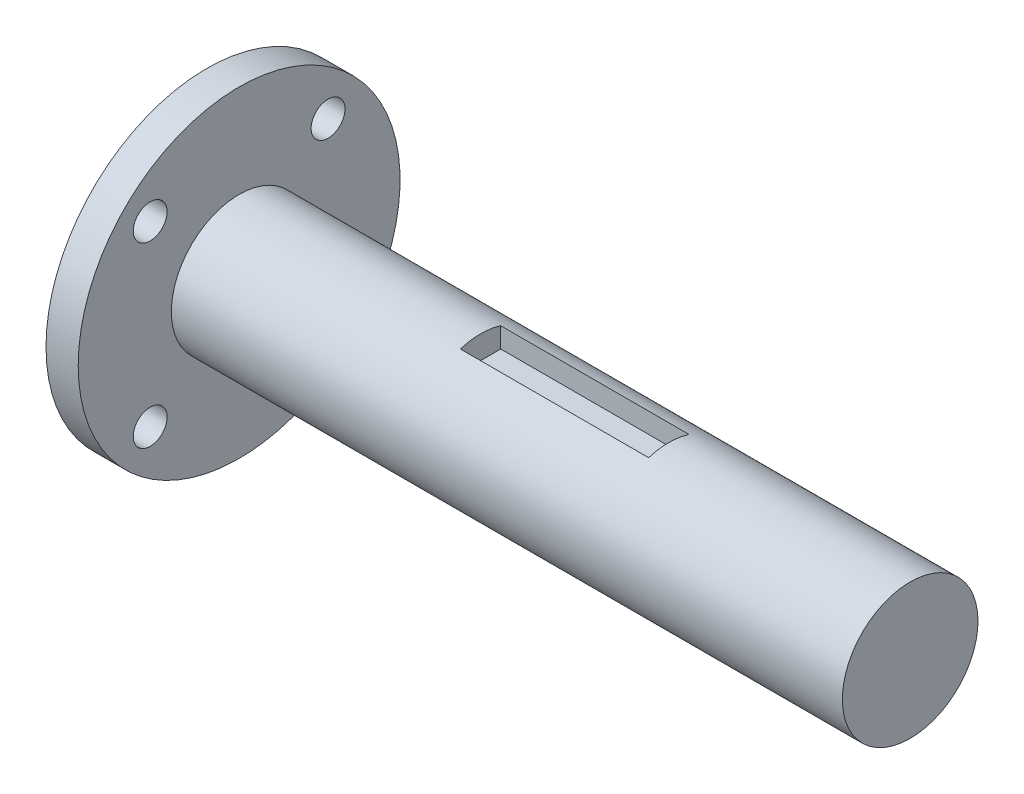
ISO-10303-21;
HEADER;
FILE_DESCRIPTION(('STEP AP214'),'2;1');
FILE_NAME('part.step','',(''),(''),'','','');
FILE_SCHEMA(('AUTOMOTIVE_DESIGN { 1 0 10303 214 1 1 1 1 }'));
ENDSEC;
DATA;
#1=APPLICATION_CONTEXT('core data for automotive mechanical design processes');
#2=APPLICATION_PROTOCOL_DEFINITION('international standard','automotive_design',2000,#1);
#3=PRODUCT_CONTEXT('',#1,'mechanical');
#4=PRODUCT('Part','Part','',(#3));
#5=PRODUCT_RELATED_PRODUCT_CATEGORY('part','',(#4));
#6=PRODUCT_DEFINITION_FORMATION('','',#4);
#7=PRODUCT_DEFINITION_CONTEXT('part definition',#1,'design');
#8=PRODUCT_DEFINITION('design','',#6,#7);
#9=PRODUCT_DEFINITION_SHAPE('','',#8);
#10=(LENGTH_UNIT() NAMED_UNIT(*) SI_UNIT(.MILLI.,.METRE.));
#11=(NAMED_UNIT(*) PLANE_ANGLE_UNIT() SI_UNIT($,.RADIAN.));
#12=(NAMED_UNIT(*) SI_UNIT($,.STERADIAN.) SOLID_ANGLE_UNIT());
#13=UNCERTAINTY_MEASURE_WITH_UNIT(LENGTH_MEASURE(1.E-05),#10,'distance_accuracy_value','');
#14=(GEOMETRIC_REPRESENTATION_CONTEXT(3) GLOBAL_UNCERTAINTY_ASSIGNED_CONTEXT((#13)) GLOBAL_UNIT_ASSIGNED_CONTEXT((#10,
#11,#12)) REPRESENTATION_CONTEXT('',''));
#15=CARTESIAN_POINT('',(0.,0.,0.));
#16=DIRECTION('',(0.,0.,1.));
#17=DIRECTION('',(1.,0.,0.));
#18=AXIS2_PLACEMENT_3D('',#15,#16,#17);
#19=CARTESIAN_POINT('',(28.5,0.,0.));
#20=DIRECTION('',(-1.,0.,0.));
#21=DIRECTION('',(0.,0.,1.));
#22=AXIS2_PLACEMENT_3D('',#19,#20,#21);
#23=CYLINDRICAL_SURFACE('',#22,8.005);
#24=CARTESIAN_POINT('',(28.5,0.,0.));
#25=DIRECTION('',(1.,0.,0.));
#26=DIRECTION('',(0.,0.,-1.));
#27=AXIS2_PLACEMENT_3D('',#24,#25,#26);
#28=CIRCLE('',#27,8.005);
#29=CARTESIAN_POINT('',(28.5,7.64254425894937,-2.3815));
#30=VERTEX_POINT('',#29);
#31=CARTESIAN_POINT('',(28.5,7.64254425894937,2.3815));
#32=VERTEX_POINT('',#31);
#33=EDGE_CURVE('E11',#30,#32,#28,.T.);
#34=ORIENTED_EDGE('',*,*,#33,.F.);
#35=DIRECTION('',(-1.,0.,0.));
#36=VECTOR('',#35,1.);
#37=CARTESIAN_POINT('',(50.725,7.64254425894937,-2.3815));
#38=LINE('',#37,#36);
#39=CARTESIAN_POINT('',(50.725,7.64254425894937,-2.3815));
#40=VERTEX_POINT('',#39);
#41=EDGE_CURVE('E102',#40,#30,#38,.T.);
#42=ORIENTED_EDGE('',*,*,#41,.F.);
#43=CARTESIAN_POINT('',(50.725,0.,0.));
#44=DIRECTION('',(1.,0.,0.));
#45=DIRECTION('',(0.,0.,-1.));
#46=AXIS2_PLACEMENT_3D('',#43,#44,#45);
#47=CIRCLE('',#46,8.005);
#48=CARTESIAN_POINT('',(50.725,7.64254425894937,2.3815));
#49=VERTEX_POINT('',#48);
#50=EDGE_CURVE('E180',#40,#49,#47,.T.);
#51=ORIENTED_EDGE('',*,*,#50,.T.);
#52=DIRECTION('',(-1.,0.,0.));
#53=VECTOR('',#52,1.);
#54=CARTESIAN_POINT('',(50.725,7.64254425894937,2.3815));
#55=LINE('',#54,#53);
#56=EDGE_CURVE('E74',#49,#32,#55,.T.);
#57=ORIENTED_EDGE('',*,*,#56,.T.);
#58=EDGE_LOOP('',(#34,#42,#51,#57));
#59=FACE_BOUND('',#58,.T.);
#60=CARTESIAN_POINT('',(0.,0.,0.));
#61=DIRECTION('',(1.,0.,0.));
#62=DIRECTION('',(0.,0.,-1.));
#63=AXIS2_PLACEMENT_3D('',#60,#61,#62);
#64=CIRCLE('',#63,8.005);
#65=CARTESIAN_POINT('',(0.,0.,-8.005));
#66=VERTEX_POINT('',#65);
#67=EDGE_CURVE('E36',#66,#66,#64,.T.);
#68=ORIENTED_EDGE('',*,*,#67,.T.);
#69=EDGE_LOOP('',(#68));
#70=FACE_BOUND('',#69,.T.);
#71=CARTESIAN_POINT('',(79.225,0.,0.));
#72=DIRECTION('',(1.,0.,0.));
#73=DIRECTION('',(0.,0.,-1.));
#74=AXIS2_PLACEMENT_3D('',#71,#72,#73);
#75=CIRCLE('',#74,8.005);
#76=CARTESIAN_POINT('',(79.225,0.,-8.005));
#77=VERTEX_POINT('',#76);
#78=EDGE_CURVE('E97',#77,#77,#75,.T.);
#79=ORIENTED_EDGE('',*,*,#78,.F.);
#80=EDGE_LOOP('',(#79));
#81=FACE_BOUND('',#80,.T.);
#82=ADVANCED_FACE('F33',(#59,#70,#81),#23,.T.);
#83=CARTESIAN_POINT('',(28.5,0.,0.));
#84=DIRECTION('',(1.,0.,0.));
#85=DIRECTION('',(0.,0.,-1.));
#86=AXIS2_PLACEMENT_3D('',#83,#84,#85);
#87=PLANE('',#86);
#88=DIRECTION('',(0.,1.,0.));
#89=VECTOR('',#88,1.);
#90=CARTESIAN_POINT('',(28.5,5.25954425894937,2.3815));
#91=LINE('',#90,#89);
#92=CARTESIAN_POINT('',(28.5,5.25954425894937,2.3815));
#93=VERTEX_POINT('',#92);
#94=EDGE_CURVE('E46',#93,#32,#91,.T.);
#95=ORIENTED_EDGE('',*,*,#94,.F.);
#96=DIRECTION('',(0.,0.,1.));
#97=VECTOR('',#96,1.);
#98=CARTESIAN_POINT('',(28.5,5.25954425894937,2.3815));
#99=LINE('',#98,#97);
#100=CARTESIAN_POINT('',(28.5,5.25954425894937,-2.3815));
#101=VERTEX_POINT('',#100);
#102=EDGE_CURVE('E80',#101,#93,#99,.T.);
#103=ORIENTED_EDGE('',*,*,#102,.F.);
#104=DIRECTION('',(0.,-1.,0.));
#105=VECTOR('',#104,1.);
#106=CARTESIAN_POINT('',(28.5,5.25954425894937,-2.3815));
#107=LINE('',#106,#105);
#108=EDGE_CURVE('E96',#30,#101,#107,.T.);
#109=ORIENTED_EDGE('',*,*,#108,.F.);
#110=ORIENTED_EDGE('',*,*,#33,.T.);
#111=EDGE_LOOP('',(#95,#103,#109,#110));
#112=FACE_BOUND('',#111,.T.);
#113=ADVANCED_FACE('F168',(#112),#87,.T.);
#114=CARTESIAN_POINT('',(-3.8,0.,0.));
#115=DIRECTION('',(-1.,0.,0.));
#116=DIRECTION('',(0.,0.,1.));
#117=AXIS2_PLACEMENT_3D('',#114,#115,#116);
#118=PLANE('',#117);
#119=CARTESIAN_POINT('',(-3.8,-10.5,10.5));
#120=DIRECTION('',(-1.,0.,0.));
#121=DIRECTION('',(0.,0.,1.));
#122=AXIS2_PLACEMENT_3D('',#119,#120,#121);
#123=CIRCLE('',#122,2.);
#124=CARTESIAN_POINT('',(-3.8,-10.5,12.5));
#125=VERTEX_POINT('',#124);
#126=EDGE_CURVE('E113',#125,#125,#123,.T.);
#127=ORIENTED_EDGE('',*,*,#126,.F.);
#128=EDGE_LOOP('',(#127));
#129=FACE_BOUND('',#128,.T.);
#130=CARTESIAN_POINT('',(-3.8,10.5,-10.5));
#131=DIRECTION('',(-1.,0.,0.));
#132=DIRECTION('',(0.,0.,1.));
#133=AXIS2_PLACEMENT_3D('',#130,#131,#132);
#134=CIRCLE('',#133,2.);
#135=CARTESIAN_POINT('',(-3.8,10.5,-8.5));
#136=VERTEX_POINT('',#135);
#137=EDGE_CURVE('E125',#136,#136,#134,.T.);
#138=ORIENTED_EDGE('',*,*,#137,.F.);
#139=EDGE_LOOP('',(#138));
#140=FACE_BOUND('',#139,.T.);
#141=CARTESIAN_POINT('',(-3.8,0.,0.));
#142=DIRECTION('',(-1.,0.,0.));
#143=DIRECTION('',(0.,0.,1.));
#144=AXIS2_PLACEMENT_3D('',#141,#142,#143);
#145=CIRCLE('',#144,19.);
#146=CARTESIAN_POINT('',(-3.8,0.,19.));
#147=VERTEX_POINT('',#146);
#148=EDGE_CURVE('E131',#147,#147,#145,.T.);
#149=ORIENTED_EDGE('',*,*,#148,.T.);
#150=EDGE_LOOP('',(#149));
#151=FACE_BOUND('',#150,.T.);
#152=CARTESIAN_POINT('',(-3.8,10.5,10.5));
#153=DIRECTION('',(-1.,0.,0.));
#154=DIRECTION('',(0.,0.,-1.));
#155=AXIS2_PLACEMENT_3D('',#152,#153,#154);
#156=CIRCLE('',#155,2.);
#157=CARTESIAN_POINT('',(-3.8,10.5,8.5));
#158=VERTEX_POINT('',#157);
#159=EDGE_CURVE('E119',#158,#158,#156,.T.);
#160=ORIENTED_EDGE('',*,*,#159,.F.);
#161=EDGE_LOOP('',(#160));
#162=FACE_BOUND('',#161,.T.);
#163=CARTESIAN_POINT('',(-3.8,-10.5,-10.5));
#164=DIRECTION('',(-1.,0.,0.));
#165=DIRECTION('',(0.,0.,-1.));
#166=AXIS2_PLACEMENT_3D('',#163,#164,#165);
#167=CIRCLE('',#166,2.);
#168=CARTESIAN_POINT('',(-3.8,-10.5,-12.5));
#169=VERTEX_POINT('',#168);
#170=EDGE_CURVE('E107',#169,#169,#167,.T.);
#171=ORIENTED_EDGE('',*,*,#170,.F.);
#172=EDGE_LOOP('',(#171));
#173=FACE_BOUND('',#172,.T.);
#174=ADVANCED_FACE('F142',(#129,#140,#151,#162,#173),#118,.T.);
#175=CARTESIAN_POINT('',(0.,0.,0.));
#176=DIRECTION('',(-1.,0.,0.));
#177=DIRECTION('',(0.,0.,1.));
#178=AXIS2_PLACEMENT_3D('',#175,#176,#177);
#179=PLANE('',#178);
#180=ORIENTED_EDGE('',*,*,#67,.F.);
#181=EDGE_LOOP('',(#180));
#182=FACE_BOUND('',#181,.T.);
#183=CARTESIAN_POINT('',(0.,0.,0.));
#184=DIRECTION('',(-1.,0.,0.));
#185=DIRECTION('',(0.,0.,1.));
#186=AXIS2_PLACEMENT_3D('',#183,#184,#185);
#187=CIRCLE('',#186,19.);
#188=CARTESIAN_POINT('',(0.,0.,19.));
#189=VERTEX_POINT('',#188);
#190=EDGE_CURVE('E128',#189,#189,#187,.T.);
#191=ORIENTED_EDGE('',*,*,#190,.F.);
#192=EDGE_LOOP('',(#191));
#193=FACE_BOUND('',#192,.T.);
#194=CARTESIAN_POINT('',(0.,10.5,-10.5));
#195=DIRECTION('',(-1.,0.,0.));
#196=DIRECTION('',(0.,0.,1.));
#197=AXIS2_PLACEMENT_3D('',#194,#195,#196);
#198=CIRCLE('',#197,2.);
#199=CARTESIAN_POINT('',(0.,10.5,-8.5));
#200=VERTEX_POINT('',#199);
#201=EDGE_CURVE('E122',#200,#200,#198,.T.);
#202=ORIENTED_EDGE('',*,*,#201,.T.);
#203=EDGE_LOOP('',(#202));
#204=FACE_BOUND('',#203,.T.);
#205=CARTESIAN_POINT('',(0.,10.5,10.5));
#206=DIRECTION('',(-1.,0.,0.));
#207=DIRECTION('',(0.,0.,-1.));
#208=AXIS2_PLACEMENT_3D('',#205,#206,#207);
#209=CIRCLE('',#208,2.);
#210=CARTESIAN_POINT('',(0.,10.5,8.5));
#211=VERTEX_POINT('',#210);
#212=EDGE_CURVE('E116',#211,#211,#209,.T.);
#213=ORIENTED_EDGE('',*,*,#212,.T.);
#214=EDGE_LOOP('',(#213));
#215=FACE_BOUND('',#214,.T.);
#216=CARTESIAN_POINT('',(0.,-10.5,10.5));
#217=DIRECTION('',(-1.,0.,0.));
#218=DIRECTION('',(0.,0.,1.));
#219=AXIS2_PLACEMENT_3D('',#216,#217,#218);
#220=CIRCLE('',#219,2.);
#221=CARTESIAN_POINT('',(0.,-10.5,12.5));
#222=VERTEX_POINT('',#221);
#223=EDGE_CURVE('E110',#222,#222,#220,.T.);
#224=ORIENTED_EDGE('',*,*,#223,.T.);
#225=EDGE_LOOP('',(#224));
#226=FACE_BOUND('',#225,.T.);
#227=CARTESIAN_POINT('',(0.,-10.5,-10.5));
#228=DIRECTION('',(-1.,0.,0.));
#229=DIRECTION('',(0.,0.,-1.));
#230=AXIS2_PLACEMENT_3D('',#227,#228,#229);
#231=CIRCLE('',#230,2.);
#232=CARTESIAN_POINT('',(0.,-10.5,-12.5));
#233=VERTEX_POINT('',#232);
#234=EDGE_CURVE('E106',#233,#233,#231,.T.);
#235=ORIENTED_EDGE('',*,*,#234,.T.);
#236=EDGE_LOOP('',(#235));
#237=FACE_BOUND('',#236,.T.);
#238=ADVANCED_FACE('F139',(#182,#193,#204,#215,#226,#237),#179,.F.);
#239=CARTESIAN_POINT('',(-3.8,0.,0.));
#240=DIRECTION('',(1.,0.,0.));
#241=DIRECTION('',(0.,0.,-1.));
#242=AXIS2_PLACEMENT_3D('',#239,#240,#241);
#243=CYLINDRICAL_SURFACE('',#242,19.);
#244=ORIENTED_EDGE('',*,*,#148,.F.);
#245=EDGE_LOOP('',(#244));
#246=FACE_BOUND('',#245,.T.);
#247=ORIENTED_EDGE('',*,*,#190,.T.);
#248=EDGE_LOOP('',(#247));
#249=FACE_BOUND('',#248,.T.);
#250=ADVANCED_FACE('F137',(#246,#249),#243,.T.);
#251=CARTESIAN_POINT('',(-3.8,10.5,-10.5));
#252=DIRECTION('',(1.,0.,0.));
#253=DIRECTION('',(0.,0.,-1.));
#254=AXIS2_PLACEMENT_3D('',#251,#252,#253);
#255=CYLINDRICAL_SURFACE('',#254,2.);
#256=ORIENTED_EDGE('',*,*,#137,.T.);
#257=EDGE_LOOP('',(#256));
#258=FACE_BOUND('',#257,.T.);
#259=ORIENTED_EDGE('',*,*,#201,.F.);
#260=EDGE_LOOP('',(#259));
#261=FACE_BOUND('',#260,.T.);
#262=ADVANCED_FACE('F248',(#258,#261),#255,.F.);
#263=CARTESIAN_POINT('',(-3.8,10.5,10.5));
#264=DIRECTION('',(1.,0.,0.));
#265=DIRECTION('',(0.,0.,-1.));
#266=AXIS2_PLACEMENT_3D('',#263,#264,#265);
#267=CYLINDRICAL_SURFACE('',#266,2.);
#268=ORIENTED_EDGE('',*,*,#159,.T.);
#269=EDGE_LOOP('',(#268));
#270=FACE_BOUND('',#269,.T.);
#271=ORIENTED_EDGE('',*,*,#212,.F.);
#272=EDGE_LOOP('',(#271));
#273=FACE_BOUND('',#272,.T.);
#274=ADVANCED_FACE('F164',(#270,#273),#267,.F.);
#275=CARTESIAN_POINT('',(-3.8,-10.5,10.5));
#276=DIRECTION('',(1.,0.,0.));
#277=DIRECTION('',(0.,0.,-1.));
#278=AXIS2_PLACEMENT_3D('',#275,#276,#277);
#279=CYLINDRICAL_SURFACE('',#278,2.);
#280=ORIENTED_EDGE('',*,*,#126,.T.);
#281=EDGE_LOOP('',(#280));
#282=FACE_BOUND('',#281,.T.);
#283=ORIENTED_EDGE('',*,*,#223,.F.);
#284=EDGE_LOOP('',(#283));
#285=FACE_BOUND('',#284,.T.);
#286=ADVANCED_FACE('F155',(#282,#285),#279,.F.);
#287=CARTESIAN_POINT('',(-3.8,-10.5,-10.5));
#288=DIRECTION('',(1.,0.,0.));
#289=DIRECTION('',(0.,0.,-1.));
#290=AXIS2_PLACEMENT_3D('',#287,#288,#289);
#291=CYLINDRICAL_SURFACE('',#290,2.);
#292=ORIENTED_EDGE('',*,*,#170,.T.);
#293=EDGE_LOOP('',(#292));
#294=FACE_BOUND('',#293,.T.);
#295=ORIENTED_EDGE('',*,*,#234,.F.);
#296=EDGE_LOOP('',(#295));
#297=FACE_BOUND('',#296,.T.);
#298=ADVANCED_FACE('F153',(#294,#297),#291,.F.);
#299=CARTESIAN_POINT('',(50.725,5.25954425894937,2.3815));
#300=DIRECTION('',(0.,0.,1.));
#301=DIRECTION('',(1.,0.,0.));
#302=AXIS2_PLACEMENT_3D('',#299,#300,#301);
#303=PLANE('',#302);
#304=ORIENTED_EDGE('',*,*,#94,.T.);
#305=ORIENTED_EDGE('',*,*,#56,.F.);
#306=DIRECTION('',(0.,1.,0.));
#307=VECTOR('',#306,1.);
#308=CARTESIAN_POINT('',(50.725,5.25954425894937,2.3815));
#309=LINE('',#308,#307);
#310=CARTESIAN_POINT('',(50.725,5.25954425894937,2.3815));
#311=VERTEX_POINT('',#310);
#312=EDGE_CURVE('E70',#311,#49,#309,.T.);
#313=ORIENTED_EDGE('',*,*,#312,.F.);
#314=DIRECTION('',(-1.,0.,0.));
#315=VECTOR('',#314,1.);
#316=CARTESIAN_POINT('',(50.725,5.25954425894937,2.3815));
#317=LINE('',#316,#315);
#318=EDGE_CURVE('E73',#311,#93,#317,.T.);
#319=ORIENTED_EDGE('',*,*,#318,.T.);
#320=EDGE_LOOP('',(#304,#305,#313,#319));
#321=FACE_BOUND('',#320,.T.);
#322=ADVANCED_FACE('F72',(#321),#303,.F.);
#323=CARTESIAN_POINT('',(50.725,5.25954425894937,-2.3815));
#324=DIRECTION('',(0.,0.,-1.));
#325=DIRECTION('',(-1.,0.,0.));
#326=AXIS2_PLACEMENT_3D('',#323,#324,#325);
#327=PLANE('',#326);
#328=ORIENTED_EDGE('',*,*,#108,.T.);
#329=DIRECTION('',(-1.,0.,0.));
#330=VECTOR('',#329,1.);
#331=CARTESIAN_POINT('',(50.725,5.25954425894937,-2.3815));
#332=LINE('',#331,#330);
#333=CARTESIAN_POINT('',(50.725,5.25954425894937,-2.3815));
#334=VERTEX_POINT('',#333);
#335=EDGE_CURVE('E88',#334,#101,#332,.T.);
#336=ORIENTED_EDGE('',*,*,#335,.F.);
#337=DIRECTION('',(0.,-1.,0.));
#338=VECTOR('',#337,1.);
#339=CARTESIAN_POINT('',(50.725,5.25954425894937,-2.3815));
#340=LINE('',#339,#338);
#341=EDGE_CURVE('E79',#40,#334,#340,.T.);
#342=ORIENTED_EDGE('',*,*,#341,.F.);
#343=ORIENTED_EDGE('',*,*,#41,.T.);
#344=EDGE_LOOP('',(#328,#336,#342,#343));
#345=FACE_BOUND('',#344,.T.);
#346=ADVANCED_FACE('F162',(#345),#327,.F.);
#347=CARTESIAN_POINT('',(50.725,5.25954425894937,2.3815));
#348=DIRECTION('',(0.,-1.,0.));
#349=DIRECTION('',(0.,0.,-1.));
#350=AXIS2_PLACEMENT_3D('',#347,#348,#349);
#351=PLANE('',#350);
#352=ORIENTED_EDGE('',*,*,#102,.T.);
#353=ORIENTED_EDGE('',*,*,#318,.F.);
#354=DIRECTION('',(0.,0.,1.));
#355=VECTOR('',#354,1.);
#356=CARTESIAN_POINT('',(50.725,5.25954425894937,2.3815));
#357=LINE('',#356,#355);
#358=EDGE_CURVE('E86',#334,#311,#357,.T.);
#359=ORIENTED_EDGE('',*,*,#358,.F.);
#360=ORIENTED_EDGE('',*,*,#335,.T.);
#361=EDGE_LOOP('',(#352,#353,#359,#360));
#362=FACE_BOUND('',#361,.T.);
#363=ADVANCED_FACE('F84',(#362),#351,.F.);
#364=CARTESIAN_POINT('',(50.725,0.,0.));
#365=DIRECTION('',(1.,0.,0.));
#366=DIRECTION('',(0.,0.,-1.));
#367=AXIS2_PLACEMENT_3D('',#364,#365,#366);
#368=PLANE('',#367);
#369=ORIENTED_EDGE('',*,*,#358,.T.);
#370=ORIENTED_EDGE('',*,*,#312,.T.);
#371=ORIENTED_EDGE('',*,*,#50,.F.);
#372=ORIENTED_EDGE('',*,*,#341,.T.);
#373=EDGE_LOOP('',(#369,#370,#371,#372));
#374=FACE_BOUND('',#373,.T.);
#375=ADVANCED_FACE('F90',(#374),#368,.F.);
#376=CARTESIAN_POINT('',(79.225,0.,0.));
#377=DIRECTION('',(1.,0.,0.));
#378=DIRECTION('',(0.,0.,-1.));
#379=AXIS2_PLACEMENT_3D('',#376,#377,#378);
#380=PLANE('',#379);
#381=ORIENTED_EDGE('',*,*,#78,.T.);
#382=EDGE_LOOP('',(#381));
#383=FACE_BOUND('',#382,.T.);
#384=ADVANCED_FACE('F193',(#383),#380,.T.);
#385=CLOSED_SHELL('',(#82,#113,#174,#238,#250,#262,#274,#286,#298,#322,#346,#363,#375,#384));
#386=MANIFOLD_SOLID_BREP('B2',#385);
#387=ADVANCED_BREP_SHAPE_REPRESENTATION('',(#18,#386),#14);
#388=SHAPE_DEFINITION_REPRESENTATION(#9,#387);
ENDSEC;
END-ISO-10303-21;
